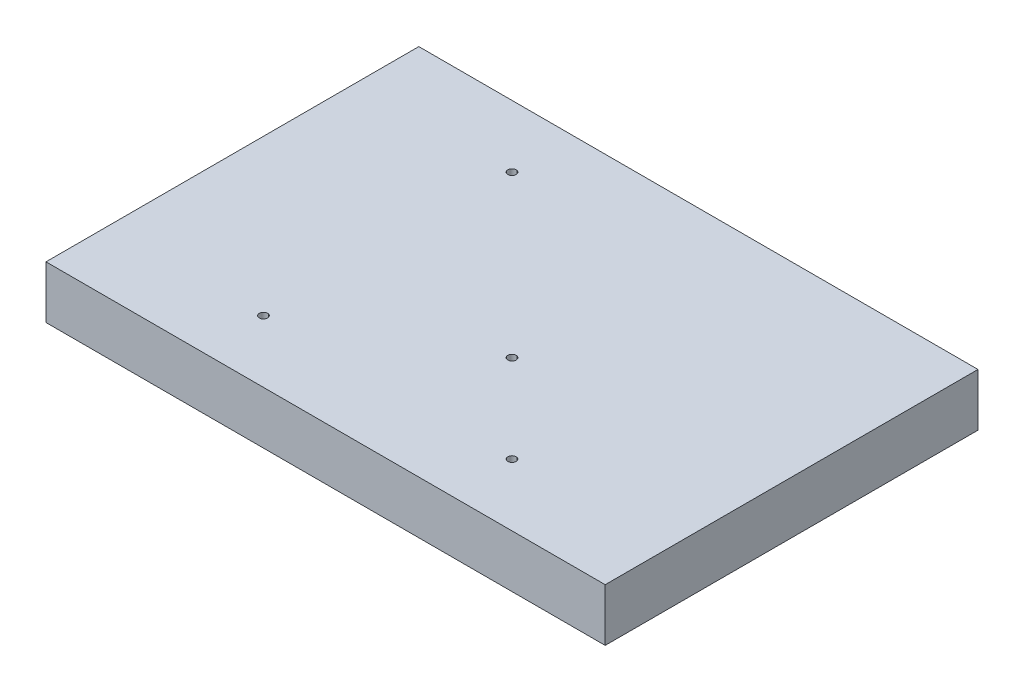
ISO-10303-21;
HEADER;
FILE_DESCRIPTION(('STEP AP214'),'2;1');
FILE_NAME('part.step','',(''),(''),'','','');
FILE_SCHEMA(('AUTOMOTIVE_DESIGN { 1 0 10303 214 1 1 1 1 }'));
ENDSEC;
DATA;
#1=APPLICATION_CONTEXT('core data for automotive mechanical design processes');
#2=APPLICATION_PROTOCOL_DEFINITION('international standard','automotive_design',2000,#1);
#3=PRODUCT_CONTEXT('',#1,'mechanical');
#4=PRODUCT('Part','Part','',(#3));
#5=PRODUCT_RELATED_PRODUCT_CATEGORY('part','',(#4));
#6=PRODUCT_DEFINITION_FORMATION('','',#4);
#7=PRODUCT_DEFINITION_CONTEXT('part definition',#1,'design');
#8=PRODUCT_DEFINITION('design','',#6,#7);
#9=PRODUCT_DEFINITION_SHAPE('','',#8);
#10=(LENGTH_UNIT() NAMED_UNIT(*) SI_UNIT(.MILLI.,.METRE.));
#11=(NAMED_UNIT(*) PLANE_ANGLE_UNIT() SI_UNIT($,.RADIAN.));
#12=(NAMED_UNIT(*) SI_UNIT($,.STERADIAN.) SOLID_ANGLE_UNIT());
#13=UNCERTAINTY_MEASURE_WITH_UNIT(LENGTH_MEASURE(1.E-05),#10,'distance_accuracy_value','');
#14=(GEOMETRIC_REPRESENTATION_CONTEXT(3) GLOBAL_UNCERTAINTY_ASSIGNED_CONTEXT((#13)) GLOBAL_UNIT_ASSIGNED_CONTEXT((#10,
#11,#12)) REPRESENTATION_CONTEXT('',''));
#15=CARTESIAN_POINT('',(0.,0.,0.));
#16=DIRECTION('',(0.,0.,1.));
#17=DIRECTION('',(1.,0.,0.));
#18=AXIS2_PLACEMENT_3D('',#15,#16,#17);
#19=CARTESIAN_POINT('',(0.,0.,0.));
#20=DIRECTION('',(0.,1.,0.));
#21=DIRECTION('',(0.,0.,1.));
#22=AXIS2_PLACEMENT_3D('',#19,#20,#21);
#23=PLANE('',#22);
#24=CARTESIAN_POINT('',(-30.,0.,30.));
#25=DIRECTION('',(0.,1.,0.));
#26=DIRECTION('',(0.,0.,1.));
#27=AXIS2_PLACEMENT_3D('',#24,#25,#26);
#28=CIRCLE('',#27,0.999999999999998);
#29=CARTESIAN_POINT('',(-30.,0.,31.));
#30=VERTEX_POINT('',#29);
#31=EDGE_CURVE('E120',#30,#30,#28,.T.);
#32=ORIENTED_EDGE('',*,*,#31,.T.);
#33=EDGE_LOOP('',(#32));
#34=FACE_BOUND('',#33,.T.);
#35=CARTESIAN_POINT('',(-30.,0.,-30.));
#36=DIRECTION('',(0.,1.,0.));
#37=DIRECTION('',(0.,0.,1.));
#38=AXIS2_PLACEMENT_3D('',#35,#36,#37);
#39=CIRCLE('',#38,0.999999999999998);
#40=CARTESIAN_POINT('',(-30.,0.,-29.));
#41=VERTEX_POINT('',#40);
#42=EDGE_CURVE('E108',#41,#41,#39,.T.);
#43=ORIENTED_EDGE('',*,*,#42,.T.);
#44=EDGE_LOOP('',(#43));
#45=FACE_BOUND('',#44,.T.);
#46=DIRECTION('',(0.,0.,1.));
#47=VECTOR('',#46,1.);
#48=CARTESIAN_POINT('',(-67.5,0.,45.));
#49=LINE('',#48,#47);
#50=CARTESIAN_POINT('',(-67.5,0.,-45.));
#51=VERTEX_POINT('',#50);
#52=CARTESIAN_POINT('',(-67.5,0.,45.));
#53=VERTEX_POINT('',#52);
#54=EDGE_CURVE('E82',#51,#53,#49,.T.);
#55=ORIENTED_EDGE('',*,*,#54,.F.);
#56=DIRECTION('',(-1.,0.,0.));
#57=VECTOR('',#56,1.);
#58=CARTESIAN_POINT('',(67.5,0.,-45.));
#59=LINE('',#58,#57);
#60=CARTESIAN_POINT('',(67.5,0.,-45.));
#61=VERTEX_POINT('',#60);
#62=EDGE_CURVE('E88',#61,#51,#59,.T.);
#63=ORIENTED_EDGE('',*,*,#62,.F.);
#64=DIRECTION('',(0.,0.,-1.));
#65=VECTOR('',#64,1.);
#66=CARTESIAN_POINT('',(67.5,0.,45.));
#67=LINE('',#66,#65);
#68=CARTESIAN_POINT('',(67.5,0.,45.));
#69=VERTEX_POINT('',#68);
#70=EDGE_CURVE('E105',#69,#61,#67,.T.);
#71=ORIENTED_EDGE('',*,*,#70,.F.);
#72=DIRECTION('',(1.,0.,0.));
#73=VECTOR('',#72,1.);
#74=CARTESIAN_POINT('',(67.5,0.,45.));
#75=LINE('',#74,#73);
#76=EDGE_CURVE('E95',#53,#69,#75,.T.);
#77=ORIENTED_EDGE('',*,*,#76,.F.);
#78=EDGE_LOOP('',(#55,#63,#71,#77));
#79=FACE_BOUND('',#78,.T.);
#80=CARTESIAN_POINT('',(30.,0.,30.));
#81=DIRECTION('',(0.,1.,0.));
#82=DIRECTION('',(0.,0.,1.));
#83=AXIS2_PLACEMENT_3D('',#80,#81,#82);
#84=CIRCLE('',#83,0.999999999999998);
#85=CARTESIAN_POINT('',(30.,0.,31.));
#86=VERTEX_POINT('',#85);
#87=EDGE_CURVE('E114',#86,#86,#84,.T.);
#88=ORIENTED_EDGE('',*,*,#87,.T.);
#89=EDGE_LOOP('',(#88));
#90=FACE_BOUND('',#89,.T.);
#91=CARTESIAN_POINT('',(8.78679656440357,0.,8.78679656440358));
#92=DIRECTION('',(0.,1.,0.));
#93=DIRECTION('',(0.,0.,1.));
#94=AXIS2_PLACEMENT_3D('',#91,#92,#93);
#95=CIRCLE('',#94,1.);
#96=CARTESIAN_POINT('',(8.78679656440357,0.,9.78679656440358));
#97=VERTEX_POINT('',#96);
#98=EDGE_CURVE('E126',#97,#97,#95,.T.);
#99=ORIENTED_EDGE('',*,*,#98,.T.);
#100=EDGE_LOOP('',(#99));
#101=FACE_BOUND('',#100,.T.);
#102=ADVANCED_FACE('F33',(#34,#45,#79,#90,#101),#23,.F.);
#103=CARTESIAN_POINT('',(0.,12.7,0.));
#104=DIRECTION('',(0.,1.,0.));
#105=DIRECTION('',(0.,0.,1.));
#106=AXIS2_PLACEMENT_3D('',#103,#104,#105);
#107=PLANE('',#106);
#108=CARTESIAN_POINT('',(-30.,12.7,30.));
#109=DIRECTION('',(0.,1.,0.));
#110=DIRECTION('',(0.,0.,1.));
#111=AXIS2_PLACEMENT_3D('',#108,#109,#110);
#112=CIRCLE('',#111,0.999999999999998);
#113=CARTESIAN_POINT('',(-30.,12.7,31.));
#114=VERTEX_POINT('',#113);
#115=EDGE_CURVE('E117',#114,#114,#112,.T.);
#116=ORIENTED_EDGE('',*,*,#115,.F.);
#117=EDGE_LOOP('',(#116));
#118=FACE_BOUND('',#117,.T.);
#119=CARTESIAN_POINT('',(-30.,12.7,-30.));
#120=DIRECTION('',(0.,1.,0.));
#121=DIRECTION('',(0.,0.,1.));
#122=AXIS2_PLACEMENT_3D('',#119,#120,#121);
#123=CIRCLE('',#122,0.999999999999998);
#124=CARTESIAN_POINT('',(-30.,12.7,-29.));
#125=VERTEX_POINT('',#124);
#126=EDGE_CURVE('E86',#125,#125,#123,.T.);
#127=ORIENTED_EDGE('',*,*,#126,.F.);
#128=EDGE_LOOP('',(#127));
#129=FACE_BOUND('',#128,.T.);
#130=DIRECTION('',(-1.,0.,0.));
#131=VECTOR('',#130,1.);
#132=CARTESIAN_POINT('',(67.5,12.7,-45.));
#133=LINE('',#132,#131);
#134=CARTESIAN_POINT('',(67.5,12.7,-45.));
#135=VERTEX_POINT('',#134);
#136=CARTESIAN_POINT('',(-67.5,12.7,-45.));
#137=VERTEX_POINT('',#136);
#138=EDGE_CURVE('E92',#135,#137,#133,.T.);
#139=ORIENTED_EDGE('',*,*,#138,.T.);
#140=DIRECTION('',(0.,0.,1.));
#141=VECTOR('',#140,1.);
#142=CARTESIAN_POINT('',(-67.5,12.7,45.));
#143=LINE('',#142,#141);
#144=CARTESIAN_POINT('',(-67.5,12.7,45.));
#145=VERTEX_POINT('',#144);
#146=EDGE_CURVE('E84',#137,#145,#143,.T.);
#147=ORIENTED_EDGE('',*,*,#146,.T.);
#148=DIRECTION('',(1.,0.,0.));
#149=VECTOR('',#148,1.);
#150=CARTESIAN_POINT('',(67.5,12.7,45.));
#151=LINE('',#150,#149);
#152=CARTESIAN_POINT('',(67.5,12.7,45.));
#153=VERTEX_POINT('',#152);
#154=EDGE_CURVE('E42',#145,#153,#151,.T.);
#155=ORIENTED_EDGE('',*,*,#154,.T.);
#156=DIRECTION('',(0.,0.,-1.));
#157=VECTOR('',#156,1.);
#158=CARTESIAN_POINT('',(67.5,12.7,45.));
#159=LINE('',#158,#157);
#160=EDGE_CURVE('E11',#153,#135,#159,.T.);
#161=ORIENTED_EDGE('',*,*,#160,.T.);
#162=EDGE_LOOP('',(#139,#147,#155,#161));
#163=FACE_BOUND('',#162,.T.);
#164=CARTESIAN_POINT('',(30.,12.7,30.));
#165=DIRECTION('',(0.,1.,0.));
#166=DIRECTION('',(0.,0.,1.));
#167=AXIS2_PLACEMENT_3D('',#164,#165,#166);
#168=CIRCLE('',#167,0.999999999999998);
#169=CARTESIAN_POINT('',(30.,12.7,31.));
#170=VERTEX_POINT('',#169);
#171=EDGE_CURVE('E111',#170,#170,#168,.T.);
#172=ORIENTED_EDGE('',*,*,#171,.F.);
#173=EDGE_LOOP('',(#172));
#174=FACE_BOUND('',#173,.T.);
#175=CARTESIAN_POINT('',(8.78679656440357,12.7,8.78679656440358));
#176=DIRECTION('',(0.,1.,0.));
#177=DIRECTION('',(0.,0.,1.));
#178=AXIS2_PLACEMENT_3D('',#175,#176,#177);
#179=CIRCLE('',#178,1.);
#180=CARTESIAN_POINT('',(8.78679656440357,12.7,9.78679656440358));
#181=VERTEX_POINT('',#180);
#182=EDGE_CURVE('E123',#181,#181,#179,.T.);
#183=ORIENTED_EDGE('',*,*,#182,.F.);
#184=EDGE_LOOP('',(#183));
#185=FACE_BOUND('',#184,.T.);
#186=ADVANCED_FACE('F35',(#118,#129,#163,#174,#185),#107,.T.);
#187=CARTESIAN_POINT('',(-67.5,174.94980739588,45.));
#188=DIRECTION('',(1.,0.,0.));
#189=DIRECTION('',(0.,0.,-1.));
#190=AXIS2_PLACEMENT_3D('',#187,#188,#189);
#191=PLANE('',#190);
#192=ORIENTED_EDGE('',*,*,#146,.F.);
#193=DIRECTION('',(0.,-1.,0.));
#194=VECTOR('',#193,1.);
#195=CARTESIAN_POINT('',(-67.5,174.94980739588,-45.));
#196=LINE('',#195,#194);
#197=EDGE_CURVE('E37',#137,#51,#196,.T.);
#198=ORIENTED_EDGE('',*,*,#197,.T.);
#199=ORIENTED_EDGE('',*,*,#54,.T.);
#200=DIRECTION('',(0.,-1.,0.));
#201=VECTOR('',#200,1.);
#202=CARTESIAN_POINT('',(-67.5,174.94980739588,45.));
#203=LINE('',#202,#201);
#204=EDGE_CURVE('E72',#145,#53,#203,.T.);
#205=ORIENTED_EDGE('',*,*,#204,.F.);
#206=EDGE_LOOP('',(#192,#198,#199,#205));
#207=FACE_BOUND('',#206,.T.);
#208=ADVANCED_FACE('F80',(#207),#191,.F.);
#209=CARTESIAN_POINT('',(67.5,174.94980739588,45.));
#210=DIRECTION('',(0.,0.,-1.));
#211=DIRECTION('',(-1.,0.,0.));
#212=AXIS2_PLACEMENT_3D('',#209,#210,#211);
#213=PLANE('',#212);
#214=ORIENTED_EDGE('',*,*,#154,.F.);
#215=ORIENTED_EDGE('',*,*,#204,.T.);
#216=ORIENTED_EDGE('',*,*,#76,.T.);
#217=DIRECTION('',(0.,-1.,0.));
#218=VECTOR('',#217,1.);
#219=CARTESIAN_POINT('',(67.5,174.94980739588,45.));
#220=LINE('',#219,#218);
#221=EDGE_CURVE('E104',#153,#69,#220,.T.);
#222=ORIENTED_EDGE('',*,*,#221,.F.);
#223=EDGE_LOOP('',(#214,#215,#216,#222));
#224=FACE_BOUND('',#223,.T.);
#225=ADVANCED_FACE('F141',(#224),#213,.F.);
#226=CARTESIAN_POINT('',(67.5,174.94980739588,45.));
#227=DIRECTION('',(-1.,0.,0.));
#228=DIRECTION('',(0.,0.,1.));
#229=AXIS2_PLACEMENT_3D('',#226,#227,#228);
#230=PLANE('',#229);
#231=ORIENTED_EDGE('',*,*,#160,.F.);
#232=ORIENTED_EDGE('',*,*,#221,.T.);
#233=ORIENTED_EDGE('',*,*,#70,.T.);
#234=DIRECTION('',(0.,-1.,0.));
#235=VECTOR('',#234,1.);
#236=CARTESIAN_POINT('',(67.5,174.94980739588,-45.));
#237=LINE('',#236,#235);
#238=EDGE_CURVE('E55',#135,#61,#237,.T.);
#239=ORIENTED_EDGE('',*,*,#238,.F.);
#240=EDGE_LOOP('',(#231,#232,#233,#239));
#241=FACE_BOUND('',#240,.T.);
#242=ADVANCED_FACE('F173',(#241),#230,.F.);
#243=CARTESIAN_POINT('',(67.5,174.94980739588,-45.));
#244=DIRECTION('',(0.,0.,1.));
#245=DIRECTION('',(1.,0.,0.));
#246=AXIS2_PLACEMENT_3D('',#243,#244,#245);
#247=PLANE('',#246);
#248=ORIENTED_EDGE('',*,*,#138,.F.);
#249=ORIENTED_EDGE('',*,*,#238,.T.);
#250=ORIENTED_EDGE('',*,*,#62,.T.);
#251=ORIENTED_EDGE('',*,*,#197,.F.);
#252=EDGE_LOOP('',(#248,#249,#250,#251));
#253=FACE_BOUND('',#252,.T.);
#254=ADVANCED_FACE('F89',(#253),#247,.F.);
#255=CARTESIAN_POINT('',(-30.,12.7,-30.));
#256=DIRECTION('',(0.,-1.,0.));
#257=DIRECTION('',(0.,0.,-1.));
#258=AXIS2_PLACEMENT_3D('',#255,#256,#257);
#259=CYLINDRICAL_SURFACE('',#258,0.999999999999998);
#260=ORIENTED_EDGE('',*,*,#126,.T.);
#261=EDGE_LOOP('',(#260));
#262=FACE_BOUND('',#261,.T.);
#263=ORIENTED_EDGE('',*,*,#42,.F.);
#264=EDGE_LOOP('',(#263));
#265=FACE_BOUND('',#264,.T.);
#266=ADVANCED_FACE('F155',(#262,#265),#259,.F.);
#267=CARTESIAN_POINT('',(30.,12.7,30.));
#268=DIRECTION('',(0.,-1.,0.));
#269=DIRECTION('',(0.,0.,-1.));
#270=AXIS2_PLACEMENT_3D('',#267,#268,#269);
#271=CYLINDRICAL_SURFACE('',#270,0.999999999999998);
#272=ORIENTED_EDGE('',*,*,#171,.T.);
#273=EDGE_LOOP('',(#272));
#274=FACE_BOUND('',#273,.T.);
#275=ORIENTED_EDGE('',*,*,#87,.F.);
#276=EDGE_LOOP('',(#275));
#277=FACE_BOUND('',#276,.T.);
#278=ADVANCED_FACE('F151',(#274,#277),#271,.F.);
#279=CARTESIAN_POINT('',(-30.,12.7,30.));
#280=DIRECTION('',(0.,-1.,0.));
#281=DIRECTION('',(0.,0.,-1.));
#282=AXIS2_PLACEMENT_3D('',#279,#280,#281);
#283=CYLINDRICAL_SURFACE('',#282,0.999999999999998);
#284=ORIENTED_EDGE('',*,*,#115,.T.);
#285=EDGE_LOOP('',(#284));
#286=FACE_BOUND('',#285,.T.);
#287=ORIENTED_EDGE('',*,*,#31,.F.);
#288=EDGE_LOOP('',(#287));
#289=FACE_BOUND('',#288,.T.);
#290=ADVANCED_FACE('F154',(#286,#289),#283,.F.);
#291=CARTESIAN_POINT('',(8.78679656440357,12.7,8.78679656440358));
#292=DIRECTION('',(0.,-1.,0.));
#293=DIRECTION('',(0.,0.,-1.));
#294=AXIS2_PLACEMENT_3D('',#291,#292,#293);
#295=CYLINDRICAL_SURFACE('',#294,1.);
#296=ORIENTED_EDGE('',*,*,#182,.T.);
#297=EDGE_LOOP('',(#296));
#298=FACE_BOUND('',#297,.T.);
#299=ORIENTED_EDGE('',*,*,#98,.F.);
#300=EDGE_LOOP('',(#299));
#301=FACE_BOUND('',#300,.T.);
#302=ADVANCED_FACE('F132',(#298,#301),#295,.F.);
#303=CLOSED_SHELL('',(#102,#186,#208,#225,#242,#254,#266,#278,#290,#302));
#304=MANIFOLD_SOLID_BREP('B2',#303);
#305=ADVANCED_BREP_SHAPE_REPRESENTATION('',(#18,#304),#14);
#306=SHAPE_DEFINITION_REPRESENTATION(#9,#305);
ENDSEC;
END-ISO-10303-21;
